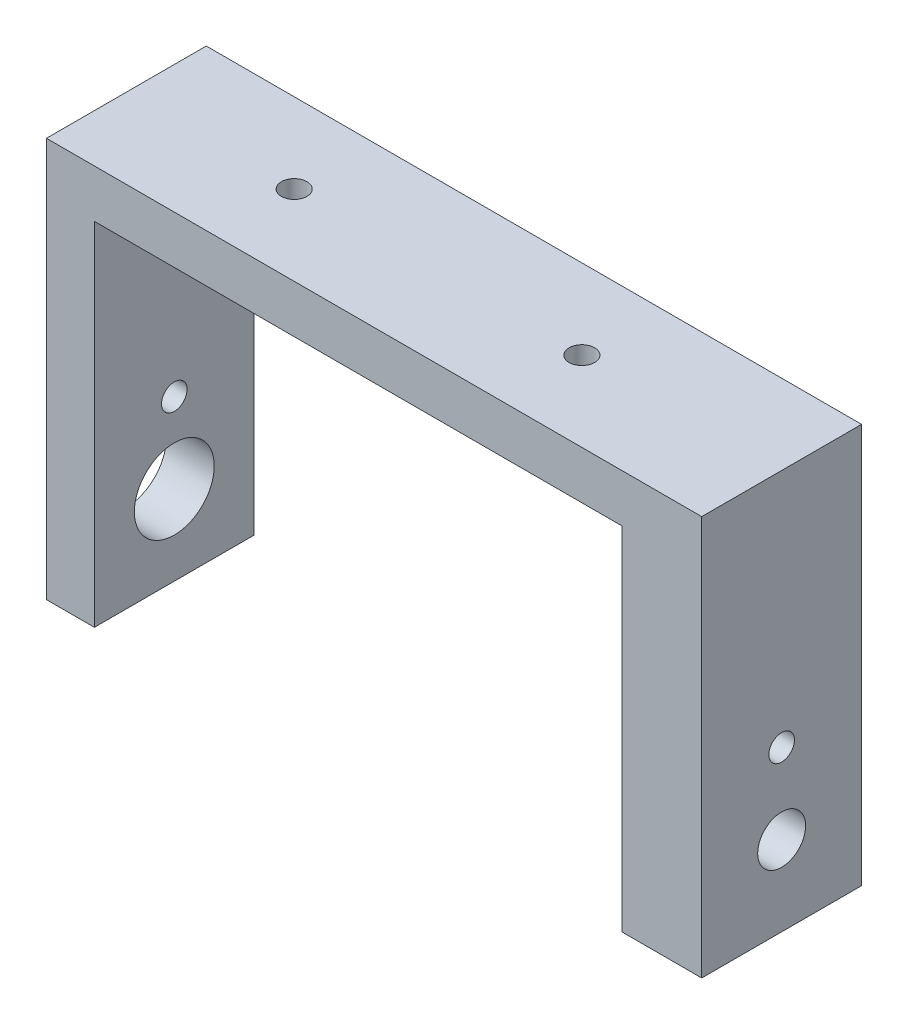
ISO-10303-21;
HEADER;
FILE_DESCRIPTION(('STEP AP214'),'2;1');
FILE_NAME('part.step','',(''),(''),'','','');
FILE_SCHEMA(('AUTOMOTIVE_DESIGN { 1 0 10303 214 1 1 1 1 }'));
ENDSEC;
DATA;
#1=APPLICATION_CONTEXT('core data for automotive mechanical design processes');
#2=APPLICATION_PROTOCOL_DEFINITION('international standard','automotive_design',2000,#1);
#3=PRODUCT_CONTEXT('',#1,'mechanical');
#4=PRODUCT('Part','Part','',(#3));
#5=PRODUCT_RELATED_PRODUCT_CATEGORY('part','',(#4));
#6=PRODUCT_DEFINITION_FORMATION('','',#4);
#7=PRODUCT_DEFINITION_CONTEXT('part definition',#1,'design');
#8=PRODUCT_DEFINITION('design','',#6,#7);
#9=PRODUCT_DEFINITION_SHAPE('','',#8);
#10=(LENGTH_UNIT() NAMED_UNIT(*) SI_UNIT(.MILLI.,.METRE.));
#11=(NAMED_UNIT(*) PLANE_ANGLE_UNIT() SI_UNIT($,.RADIAN.));
#12=(NAMED_UNIT(*) SI_UNIT($,.STERADIAN.) SOLID_ANGLE_UNIT());
#13=UNCERTAINTY_MEASURE_WITH_UNIT(LENGTH_MEASURE(1.E-05),#10,'distance_accuracy_value','');
#14=(GEOMETRIC_REPRESENTATION_CONTEXT(3) GLOBAL_UNCERTAINTY_ASSIGNED_CONTEXT((#13)) GLOBAL_UNIT_ASSIGNED_CONTEXT((#10,
#11,#12)) REPRESENTATION_CONTEXT('',''));
#15=CARTESIAN_POINT('',(0.,0.,0.));
#16=DIRECTION('',(0.,0.,1.));
#17=DIRECTION('',(1.,0.,0.));
#18=AXIS2_PLACEMENT_3D('',#15,#16,#17);
#19=CARTESIAN_POINT('',(16.5,-11.,10.));
#20=DIRECTION('',(1.,0.,0.));
#21=DIRECTION('',(0.,0.,-1.));
#22=AXIS2_PLACEMENT_3D('',#19,#20,#21);
#23=PLANE('',#22);
#24=DIRECTION('',(0.,0.,-1.));
#25=VECTOR('',#24,1.);
#26=CARTESIAN_POINT('',(16.5,-11.,10.));
#27=LINE('',#26,#25);
#28=CARTESIAN_POINT('',(16.5,-11.,1.));
#29=VERTEX_POINT('',#28);
#30=CARTESIAN_POINT('',(16.5,-11.,0.));
#31=VERTEX_POINT('',#30);
#32=EDGE_CURVE('E169',#29,#31,#27,.T.);
#33=ORIENTED_EDGE('',*,*,#32,.F.);
#34=DIRECTION('',(0.,-1.,0.));
#35=VECTOR('',#34,1.);
#36=CARTESIAN_POINT('',(16.5,-0.999999999999996,0.999999999999999));
#37=LINE('',#36,#35);
#38=CARTESIAN_POINT('',(16.5,-0.999999999999996,0.999999999999999));
#39=VERTEX_POINT('',#38);
#40=EDGE_CURVE('E256',#39,#29,#37,.T.);
#41=ORIENTED_EDGE('',*,*,#40,.F.);
#42=DIRECTION('',(0.,-0.988371697650617,-0.152057184253941));
#43=VECTOR('',#42,1.);
#44=CARTESIAN_POINT('',(16.5,12.,3.));
#45=LINE('',#44,#43);
#46=CARTESIAN_POINT('',(16.5,11.,2.84615384615384));
#47=VERTEX_POINT('',#46);
#48=EDGE_CURVE('E187',#47,#39,#45,.T.);
#49=ORIENTED_EDGE('',*,*,#48,.F.);
#50=DIRECTION('',(0.,0.,-1.));
#51=VECTOR('',#50,1.);
#52=CARTESIAN_POINT('',(16.5,11.,10.));
#53=LINE('',#52,#51);
#54=CARTESIAN_POINT('',(16.5,11.,0.));
#55=VERTEX_POINT('',#54);
#56=EDGE_CURVE('E173',#47,#55,#53,.T.);
#57=ORIENTED_EDGE('',*,*,#56,.T.);
#58=DIRECTION('',(0.,-1.,0.));
#59=VECTOR('',#58,1.);
#60=CARTESIAN_POINT('',(16.5,-11.,0.));
#61=LINE('',#60,#59);
#62=EDGE_CURVE('E151',#55,#31,#61,.T.);
#63=ORIENTED_EDGE('',*,*,#62,.T.);
#64=EDGE_LOOP('',(#33,#41,#49,#57,#63));
#65=FACE_BOUND('',#64,.T.);
#66=ADVANCED_FACE('F35',(#65),#23,.F.);
#67=CARTESIAN_POINT('',(-16.5,11.,10.));
#68=DIRECTION('',(-1.,0.,0.));
#69=DIRECTION('',(0.,0.,1.));
#70=AXIS2_PLACEMENT_3D('',#67,#68,#69);
#71=PLANE('',#70);
#72=CARTESIAN_POINT('',(-16.5,-6.,5.));
#73=DIRECTION('',(-1.,0.,0.));
#74=DIRECTION('',(0.,0.,1.));
#75=AXIS2_PLACEMENT_3D('',#72,#73,#74);
#76=CIRCLE('',#75,2.5);
#77=CARTESIAN_POINT('',(-16.5,-6.,7.5));
#78=VERTEX_POINT('',#77);
#79=EDGE_CURVE('E273',#78,#78,#76,.T.);
#80=ORIENTED_EDGE('',*,*,#79,.T.);
#81=EDGE_LOOP('',(#80));
#82=FACE_BOUND('',#81,.T.);
#83=CARTESIAN_POINT('',(-16.5,-0.999999999999994,5.));
#84=DIRECTION('',(-1.,0.,0.));
#85=DIRECTION('',(0.,0.,1.));
#86=AXIS2_PLACEMENT_3D('',#83,#84,#85);
#87=CIRCLE('',#86,0.800000000000001);
#88=CARTESIAN_POINT('',(-16.5,-0.999999999999994,5.8));
#89=VERTEX_POINT('',#88);
#90=EDGE_CURVE('E212',#89,#89,#87,.T.);
#91=ORIENTED_EDGE('',*,*,#90,.T.);
#92=EDGE_LOOP('',(#91));
#93=FACE_BOUND('',#92,.T.);
#94=DIRECTION('',(0.,1.,0.));
#95=VECTOR('',#94,1.);
#96=CARTESIAN_POINT('',(-16.5,11.,0.));
#97=LINE('',#96,#95);
#98=CARTESIAN_POINT('',(-16.5,-11.,0.));
#99=VERTEX_POINT('',#98);
#100=CARTESIAN_POINT('',(-16.5,11.,0.));
#101=VERTEX_POINT('',#100);
#102=EDGE_CURVE('E144',#99,#101,#97,.T.);
#103=ORIENTED_EDGE('',*,*,#102,.T.);
#104=DIRECTION('',(0.,0.,-1.));
#105=VECTOR('',#104,1.);
#106=CARTESIAN_POINT('',(-16.5,11.,10.));
#107=LINE('',#106,#105);
#108=CARTESIAN_POINT('',(-16.5,11.,10.));
#109=VERTEX_POINT('',#108);
#110=EDGE_CURVE('E11',#109,#101,#107,.T.);
#111=ORIENTED_EDGE('',*,*,#110,.F.);
#112=DIRECTION('',(0.,1.,0.));
#113=VECTOR('',#112,1.);
#114=CARTESIAN_POINT('',(-16.5,11.,10.));
#115=LINE('',#114,#113);
#116=CARTESIAN_POINT('',(-16.5,-11.,10.));
#117=VERTEX_POINT('',#116);
#118=EDGE_CURVE('E162',#117,#109,#115,.T.);
#119=ORIENTED_EDGE('',*,*,#118,.F.);
#120=DIRECTION('',(0.,0.,-1.));
#121=VECTOR('',#120,1.);
#122=CARTESIAN_POINT('',(-16.5,-11.,10.));
#123=LINE('',#122,#121);
#124=EDGE_CURVE('E140',#117,#99,#123,.T.);
#125=ORIENTED_EDGE('',*,*,#124,.T.);
#126=EDGE_LOOP('',(#103,#111,#119,#125));
#127=FACE_BOUND('',#126,.T.);
#128=ADVANCED_FACE('F37',(#82,#93,#127),#71,.F.);
#129=CARTESIAN_POINT('',(16.5,11.,10.));
#130=DIRECTION('',(0.,1.,0.));
#131=DIRECTION('',(0.,0.,1.));
#132=AXIS2_PLACEMENT_3D('',#129,#130,#131);
#133=PLANE('',#132);
#134=CARTESIAN_POINT('',(9.00000000000001,11.,5.));
#135=DIRECTION('',(0.,1.,0.));
#136=DIRECTION('',(0.,0.,1.));
#137=AXIS2_PLACEMENT_3D('',#134,#135,#136);
#138=CIRCLE('',#137,0.800000000000001);
#139=CARTESIAN_POINT('',(9.00000000000001,11.,5.8));
#140=VERTEX_POINT('',#139);
#141=EDGE_CURVE('E227',#140,#140,#138,.T.);
#142=ORIENTED_EDGE('',*,*,#141,.T.);
#143=EDGE_LOOP('',(#142));
#144=FACE_BOUND('',#143,.T.);
#145=CARTESIAN_POINT('',(-8.99999999999999,11.,5.));
#146=DIRECTION('',(0.,1.,0.));
#147=DIRECTION('',(0.,0.,1.));
#148=AXIS2_PLACEMENT_3D('',#145,#146,#147);
#149=CIRCLE('',#148,0.800000000000001);
#150=CARTESIAN_POINT('',(-8.99999999999999,11.,5.8));
#151=VERTEX_POINT('',#150);
#152=EDGE_CURVE('E219',#151,#151,#149,.T.);
#153=ORIENTED_EDGE('',*,*,#152,.T.);
#154=EDGE_LOOP('',(#153));
#155=FACE_BOUND('',#154,.T.);
#156=DIRECTION('',(1.,0.,0.));
#157=VECTOR('',#156,1.);
#158=CARTESIAN_POINT('',(16.5,11.,0.));
#159=LINE('',#158,#157);
#160=EDGE_CURVE('E147',#101,#55,#159,.T.);
#161=ORIENTED_EDGE('',*,*,#160,.T.);
#162=ORIENTED_EDGE('',*,*,#56,.F.);
#163=DIRECTION('',(0.,0.,-1.));
#164=VECTOR('',#163,1.);
#165=CARTESIAN_POINT('',(16.5,11.,10.));
#166=LINE('',#165,#164);
#167=CARTESIAN_POINT('',(16.5,11.,7.15384615384615));
#168=VERTEX_POINT('',#167);
#169=EDGE_CURVE('E236',#168,#47,#166,.T.);
#170=ORIENTED_EDGE('',*,*,#169,.F.);
#171=CARTESIAN_POINT('',(16.5,11.,10.));
#172=VERTEX_POINT('',#171);
#173=EDGE_CURVE('E44',#172,#168,#53,.T.);
#174=ORIENTED_EDGE('',*,*,#173,.F.);
#175=DIRECTION('',(1.,0.,0.));
#176=VECTOR('',#175,1.);
#177=CARTESIAN_POINT('',(16.5,11.,10.));
#178=LINE('',#177,#176);
#179=EDGE_CURVE('E101',#109,#172,#178,.T.);
#180=ORIENTED_EDGE('',*,*,#179,.F.);
#181=ORIENTED_EDGE('',*,*,#110,.T.);
#182=EDGE_LOOP('',(#161,#162,#170,#174,#180,#181));
#183=FACE_BOUND('',#182,.T.);
#184=ADVANCED_FACE('F189',(#144,#155,#183),#133,.F.);
#185=ORIENTED_EDGE('',*,*,#173,.T.);
#186=DIRECTION('',(0.,0.988371697650617,-0.152057184253941));
#187=VECTOR('',#186,1.);
#188=CARTESIAN_POINT('',(16.5,12.,7.));
#189=LINE('',#188,#187);
#190=CARTESIAN_POINT('',(16.5,-0.999999999999996,9.));
#191=VERTEX_POINT('',#190);
#192=EDGE_CURVE('E266',#191,#168,#189,.T.);
#193=ORIENTED_EDGE('',*,*,#192,.F.);
#194=DIRECTION('',(0.,1.,0.));
#195=VECTOR('',#194,1.);
#196=CARTESIAN_POINT('',(16.5,-0.999999999999996,9.));
#197=LINE('',#196,#195);
#198=CARTESIAN_POINT('',(16.5,-11.,9.));
#199=VERTEX_POINT('',#198);
#200=EDGE_CURVE('E270',#199,#191,#197,.T.);
#201=ORIENTED_EDGE('',*,*,#200,.F.);
#202=CARTESIAN_POINT('',(16.5,-11.,10.));
#203=VERTEX_POINT('',#202);
#204=EDGE_CURVE('E170',#203,#199,#27,.T.);
#205=ORIENTED_EDGE('',*,*,#204,.F.);
#206=DIRECTION('',(0.,-1.,0.));
#207=VECTOR('',#206,1.);
#208=CARTESIAN_POINT('',(16.5,-11.,10.));
#209=LINE('',#208,#207);
#210=EDGE_CURVE('E204',#172,#203,#209,.T.);
#211=ORIENTED_EDGE('',*,*,#210,.F.);
#212=EDGE_LOOP('',(#185,#193,#201,#205,#211));
#213=FACE_BOUND('',#212,.T.);
#214=ADVANCED_FACE('F315',(#213),#23,.F.);
#215=CARTESIAN_POINT('',(16.5,-11.,10.));
#216=DIRECTION('',(0.,1.,0.));
#217=DIRECTION('',(-1.,0.,0.));
#218=AXIS2_PLACEMENT_3D('',#215,#216,#217);
#219=PLANE('',#218);
#220=DIRECTION('',(0.,0.,1.));
#221=VECTOR('',#220,1.);
#222=CARTESIAN_POINT('',(18.5,-11.,1.));
#223=LINE('',#222,#221);
#224=CARTESIAN_POINT('',(18.5,-11.,0.999999999999999));
#225=VERTEX_POINT('',#224);
#226=CARTESIAN_POINT('',(18.5,-11.,9.));
#227=VERTEX_POINT('',#226);
#228=EDGE_CURVE('E259',#225,#227,#223,.T.);
#229=ORIENTED_EDGE('',*,*,#228,.F.);
#230=DIRECTION('',(-1.,0.,0.));
#231=VECTOR('',#230,1.);
#232=CARTESIAN_POINT('',(18.5,-11.,1.));
#233=LINE('',#232,#231);
#234=EDGE_CURVE('E239',#225,#29,#233,.T.);
#235=ORIENTED_EDGE('',*,*,#234,.T.);
#236=ORIENTED_EDGE('',*,*,#32,.T.);
#237=DIRECTION('',(1.,0.,0.));
#238=VECTOR('',#237,1.);
#239=CARTESIAN_POINT('',(16.5,-11.,0.));
#240=LINE('',#239,#238);
#241=CARTESIAN_POINT('',(21.5,-11.,0.));
#242=VERTEX_POINT('',#241);
#243=EDGE_CURVE('E154',#31,#242,#240,.T.);
#244=ORIENTED_EDGE('',*,*,#243,.T.);
#245=DIRECTION('',(0.,0.,-1.));
#246=VECTOR('',#245,1.);
#247=CARTESIAN_POINT('',(21.5,-11.,10.));
#248=LINE('',#247,#246);
#249=CARTESIAN_POINT('',(21.5,-11.,10.));
#250=VERTEX_POINT('',#249);
#251=EDGE_CURVE('E166',#250,#242,#248,.T.);
#252=ORIENTED_EDGE('',*,*,#251,.F.);
#253=DIRECTION('',(1.,0.,0.));
#254=VECTOR('',#253,1.);
#255=CARTESIAN_POINT('',(16.5,-11.,10.));
#256=LINE('',#255,#254);
#257=EDGE_CURVE('E203',#203,#250,#256,.T.);
#258=ORIENTED_EDGE('',*,*,#257,.F.);
#259=ORIENTED_EDGE('',*,*,#204,.T.);
#260=DIRECTION('',(-1.,0.,0.));
#261=VECTOR('',#260,1.);
#262=CARTESIAN_POINT('',(18.5,-11.,9.));
#263=LINE('',#262,#261);
#264=EDGE_CURVE('E240',#227,#199,#263,.T.);
#265=ORIENTED_EDGE('',*,*,#264,.F.);
#266=EDGE_LOOP('',(#229,#235,#236,#244,#252,#258,#259,#265));
#267=FACE_BOUND('',#266,.T.);
#268=ADVANCED_FACE('F198',(#267),#219,.F.);
#269=CARTESIAN_POINT('',(21.5,-11.,10.));
#270=DIRECTION('',(-1.,0.,0.));
#271=DIRECTION('',(0.,0.,1.));
#272=AXIS2_PLACEMENT_3D('',#269,#270,#271);
#273=PLANE('',#272);
#274=CARTESIAN_POINT('',(21.5,-0.999999999999994,5.));
#275=DIRECTION('',(-1.,0.,0.));
#276=DIRECTION('',(0.,0.,1.));
#277=AXIS2_PLACEMENT_3D('',#274,#275,#276);
#278=CIRCLE('',#277,0.800000000000001);
#279=CARTESIAN_POINT('',(21.5,-0.999999999999994,5.8));
#280=VERTEX_POINT('',#279);
#281=EDGE_CURVE('E215',#280,#280,#278,.T.);
#282=ORIENTED_EDGE('',*,*,#281,.T.);
#283=EDGE_LOOP('',(#282));
#284=FACE_BOUND('',#283,.T.);
#285=CARTESIAN_POINT('',(21.5,-6.,5.));
#286=DIRECTION('',(-1.,0.,0.));
#287=DIRECTION('',(0.,0.,1.));
#288=AXIS2_PLACEMENT_3D('',#285,#286,#287);
#289=CIRCLE('',#288,1.5);
#290=CARTESIAN_POINT('',(21.5,-6.,6.5));
#291=VERTEX_POINT('',#290);
#292=EDGE_CURVE('E148',#291,#291,#289,.T.);
#293=ORIENTED_EDGE('',*,*,#292,.T.);
#294=EDGE_LOOP('',(#293));
#295=FACE_BOUND('',#294,.T.);
#296=DIRECTION('',(0.,1.,0.));
#297=VECTOR('',#296,1.);
#298=CARTESIAN_POINT('',(21.5,-11.,0.));
#299=LINE('',#298,#297);
#300=CARTESIAN_POINT('',(21.5,14.,0.));
#301=VERTEX_POINT('',#300);
#302=EDGE_CURVE('E156',#242,#301,#299,.T.);
#303=ORIENTED_EDGE('',*,*,#302,.T.);
#304=DIRECTION('',(0.,0.,-1.));
#305=VECTOR('',#304,1.);
#306=CARTESIAN_POINT('',(21.5,14.,10.));
#307=LINE('',#306,#305);
#308=CARTESIAN_POINT('',(21.5,14.,10.));
#309=VERTEX_POINT('',#308);
#310=EDGE_CURVE('E135',#309,#301,#307,.T.);
#311=ORIENTED_EDGE('',*,*,#310,.F.);
#312=DIRECTION('',(0.,1.,0.));
#313=VECTOR('',#312,1.);
#314=CARTESIAN_POINT('',(21.5,-11.,10.));
#315=LINE('',#314,#313);
#316=EDGE_CURVE('E123',#250,#309,#315,.T.);
#317=ORIENTED_EDGE('',*,*,#316,.F.);
#318=ORIENTED_EDGE('',*,*,#251,.T.);
#319=EDGE_LOOP('',(#303,#311,#317,#318));
#320=FACE_BOUND('',#319,.T.);
#321=ADVANCED_FACE('F202',(#284,#295,#320),#273,.F.);
#322=CARTESIAN_POINT('',(21.5,14.,10.));
#323=DIRECTION('',(0.,-1.,0.));
#324=DIRECTION('',(0.,0.,-1.));
#325=AXIS2_PLACEMENT_3D('',#322,#323,#324);
#326=PLANE('',#325);
#327=CARTESIAN_POINT('',(9.00000000000001,14.,5.));
#328=DIRECTION('',(0.,1.,0.));
#329=DIRECTION('',(0.,0.,1.));
#330=AXIS2_PLACEMENT_3D('',#327,#328,#329);
#331=CIRCLE('',#330,0.800000000000001);
#332=CARTESIAN_POINT('',(9.00000000000001,14.,5.8));
#333=VERTEX_POINT('',#332);
#334=EDGE_CURVE('E230',#333,#333,#331,.T.);
#335=ORIENTED_EDGE('',*,*,#334,.F.);
#336=EDGE_LOOP('',(#335));
#337=FACE_BOUND('',#336,.T.);
#338=CARTESIAN_POINT('',(-8.99999999999999,14.,5.));
#339=DIRECTION('',(0.,1.,0.));
#340=DIRECTION('',(0.,0.,1.));
#341=AXIS2_PLACEMENT_3D('',#338,#339,#340);
#342=CIRCLE('',#341,0.800000000000001);
#343=CARTESIAN_POINT('',(-8.99999999999999,14.,5.8));
#344=VERTEX_POINT('',#343);
#345=EDGE_CURVE('E224',#344,#344,#342,.T.);
#346=ORIENTED_EDGE('',*,*,#345,.F.);
#347=EDGE_LOOP('',(#346));
#348=FACE_BOUND('',#347,.T.);
#349=DIRECTION('',(-1.,0.,0.));
#350=VECTOR('',#349,1.);
#351=CARTESIAN_POINT('',(21.5,14.,0.));
#352=LINE('',#351,#350);
#353=CARTESIAN_POINT('',(-19.5,14.,0.));
#354=VERTEX_POINT('',#353);
#355=EDGE_CURVE('E132',#301,#354,#352,.T.);
#356=ORIENTED_EDGE('',*,*,#355,.T.);
#357=DIRECTION('',(0.,0.,-1.));
#358=VECTOR('',#357,1.);
#359=CARTESIAN_POINT('',(-19.5,14.,10.));
#360=LINE('',#359,#358);
#361=CARTESIAN_POINT('',(-19.5,14.,10.));
#362=VERTEX_POINT('',#361);
#363=EDGE_CURVE('E129',#362,#354,#360,.T.);
#364=ORIENTED_EDGE('',*,*,#363,.F.);
#365=DIRECTION('',(-1.,0.,0.));
#366=VECTOR('',#365,1.);
#367=CARTESIAN_POINT('',(21.5,14.,10.));
#368=LINE('',#367,#366);
#369=EDGE_CURVE('E116',#309,#362,#368,.T.);
#370=ORIENTED_EDGE('',*,*,#369,.F.);
#371=ORIENTED_EDGE('',*,*,#310,.T.);
#372=EDGE_LOOP('',(#356,#364,#370,#371));
#373=FACE_BOUND('',#372,.T.);
#374=ADVANCED_FACE('F130',(#337,#348,#373),#326,.F.);
#375=CARTESIAN_POINT('',(-19.5,-11.,10.));
#376=DIRECTION('',(1.,0.,0.));
#377=DIRECTION('',(0.,0.,-1.));
#378=AXIS2_PLACEMENT_3D('',#375,#376,#377);
#379=PLANE('',#378);
#380=CARTESIAN_POINT('',(-19.5,-6.,5.));
#381=DIRECTION('',(-1.,0.,0.));
#382=DIRECTION('',(0.,0.,1.));
#383=AXIS2_PLACEMENT_3D('',#380,#381,#382);
#384=CIRCLE('',#383,2.5);
#385=CARTESIAN_POINT('',(-19.5,-6.,7.5));
#386=VERTEX_POINT('',#385);
#387=EDGE_CURVE('E289',#386,#386,#384,.T.);
#388=ORIENTED_EDGE('',*,*,#387,.F.);
#389=EDGE_LOOP('',(#388));
#390=FACE_BOUND('',#389,.T.);
#391=CARTESIAN_POINT('',(-19.5,-0.999999999999994,5.));
#392=DIRECTION('',(-1.,0.,0.));
#393=DIRECTION('',(0.,0.,1.));
#394=AXIS2_PLACEMENT_3D('',#391,#392,#393);
#395=CIRCLE('',#394,0.800000000000001);
#396=CARTESIAN_POINT('',(-19.5,-0.999999999999994,5.8));
#397=VERTEX_POINT('',#396);
#398=EDGE_CURVE('E216',#397,#397,#395,.T.);
#399=ORIENTED_EDGE('',*,*,#398,.F.);
#400=EDGE_LOOP('',(#399));
#401=FACE_BOUND('',#400,.T.);
#402=DIRECTION('',(0.,-1.,0.));
#403=VECTOR('',#402,1.);
#404=CARTESIAN_POINT('',(-19.5,-11.,0.));
#405=LINE('',#404,#403);
#406=CARTESIAN_POINT('',(-19.5,-11.,0.));
#407=VERTEX_POINT('',#406);
#408=EDGE_CURVE('E159',#354,#407,#405,.T.);
#409=ORIENTED_EDGE('',*,*,#408,.T.);
#410=DIRECTION('',(0.,0.,-1.));
#411=VECTOR('',#410,1.);
#412=CARTESIAN_POINT('',(-19.5,-11.,10.));
#413=LINE('',#412,#411);
#414=CARTESIAN_POINT('',(-19.5,-11.,10.));
#415=VERTEX_POINT('',#414);
#416=EDGE_CURVE('E136',#415,#407,#413,.T.);
#417=ORIENTED_EDGE('',*,*,#416,.F.);
#418=DIRECTION('',(0.,-1.,0.));
#419=VECTOR('',#418,1.);
#420=CARTESIAN_POINT('',(-19.5,-11.,10.));
#421=LINE('',#420,#419);
#422=EDGE_CURVE('E120',#362,#415,#421,.T.);
#423=ORIENTED_EDGE('',*,*,#422,.F.);
#424=ORIENTED_EDGE('',*,*,#363,.T.);
#425=EDGE_LOOP('',(#409,#417,#423,#424));
#426=FACE_BOUND('',#425,.T.);
#427=ADVANCED_FACE('F138',(#390,#401,#426),#379,.F.);
#428=CARTESIAN_POINT('',(-16.5,-11.,10.));
#429=DIRECTION('',(0.,1.,0.));
#430=DIRECTION('',(0.,0.,1.));
#431=AXIS2_PLACEMENT_3D('',#428,#429,#430);
#432=PLANE('',#431);
#433=DIRECTION('',(1.,0.,0.));
#434=VECTOR('',#433,1.);
#435=CARTESIAN_POINT('',(-16.5,-11.,0.));
#436=LINE('',#435,#434);
#437=EDGE_CURVE('E93',#407,#99,#436,.T.);
#438=ORIENTED_EDGE('',*,*,#437,.T.);
#439=ORIENTED_EDGE('',*,*,#124,.F.);
#440=DIRECTION('',(1.,0.,0.));
#441=VECTOR('',#440,1.);
#442=CARTESIAN_POINT('',(-16.5,-11.,10.));
#443=LINE('',#442,#441);
#444=EDGE_CURVE('E60',#415,#117,#443,.T.);
#445=ORIENTED_EDGE('',*,*,#444,.F.);
#446=ORIENTED_EDGE('',*,*,#416,.T.);
#447=EDGE_LOOP('',(#438,#439,#445,#446));
#448=FACE_BOUND('',#447,.T.);
#449=ADVANCED_FACE('F298',(#448),#432,.F.);
#450=CARTESIAN_POINT('',(0.,0.,10.));
#451=DIRECTION('',(0.,0.,-1.));
#452=DIRECTION('',(-1.,0.,0.));
#453=AXIS2_PLACEMENT_3D('',#450,#451,#452);
#454=PLANE('',#453);
#455=ORIENTED_EDGE('',*,*,#118,.T.);
#456=ORIENTED_EDGE('',*,*,#179,.T.);
#457=ORIENTED_EDGE('',*,*,#210,.T.);
#458=ORIENTED_EDGE('',*,*,#257,.T.);
#459=ORIENTED_EDGE('',*,*,#316,.T.);
#460=ORIENTED_EDGE('',*,*,#369,.T.);
#461=ORIENTED_EDGE('',*,*,#422,.T.);
#462=ORIENTED_EDGE('',*,*,#444,.T.);
#463=EDGE_LOOP('',(#455,#456,#457,#458,#459,#460,#461,#462));
#464=FACE_BOUND('',#463,.T.);
#465=ADVANCED_FACE('F118',(#464),#454,.F.);
#466=CARTESIAN_POINT('',(0.,0.,0.));
#467=DIRECTION('',(0.,0.,-1.));
#468=DIRECTION('',(-1.,0.,0.));
#469=AXIS2_PLACEMENT_3D('',#466,#467,#468);
#470=PLANE('',#469);
#471=ORIENTED_EDGE('',*,*,#102,.F.);
#472=ORIENTED_EDGE('',*,*,#437,.F.);
#473=ORIENTED_EDGE('',*,*,#408,.F.);
#474=ORIENTED_EDGE('',*,*,#355,.F.);
#475=ORIENTED_EDGE('',*,*,#302,.F.);
#476=ORIENTED_EDGE('',*,*,#243,.F.);
#477=ORIENTED_EDGE('',*,*,#62,.F.);
#478=ORIENTED_EDGE('',*,*,#160,.F.);
#479=EDGE_LOOP('',(#471,#472,#473,#474,#475,#476,#477,#478));
#480=FACE_BOUND('',#479,.T.);
#481=ADVANCED_FACE('F193',(#480),#470,.T.);
#482=CARTESIAN_POINT('',(21.5,-6.,5.));
#483=DIRECTION('',(-1.,0.,0.));
#484=DIRECTION('',(0.,0.,1.));
#485=AXIS2_PLACEMENT_3D('',#482,#483,#484);
#486=CYLINDRICAL_SURFACE('',#485,1.5);
#487=CARTESIAN_POINT('',(18.5,-6.,5.));
#488=DIRECTION('',(1.,0.,0.));
#489=DIRECTION('',(0.,0.,-1.));
#490=AXIS2_PLACEMENT_3D('',#487,#488,#489);
#491=CIRCLE('',#490,1.5);
#492=CARTESIAN_POINT('',(18.5,-6.,3.5));
#493=VERTEX_POINT('',#492);
#494=EDGE_CURVE('E233',#493,#493,#491,.F.);
#495=ORIENTED_EDGE('',*,*,#494,.T.);
#496=EDGE_LOOP('',(#495));
#497=FACE_BOUND('',#496,.T.);
#498=ORIENTED_EDGE('',*,*,#292,.F.);
#499=EDGE_LOOP('',(#498));
#500=FACE_BOUND('',#499,.T.);
#501=ADVANCED_FACE('F306',(#497,#500),#486,.F.);
#502=CARTESIAN_POINT('',(21.5,-0.999999999999994,5.));
#503=DIRECTION('',(-1.,0.,0.));
#504=DIRECTION('',(0.,0.,1.));
#505=AXIS2_PLACEMENT_3D('',#502,#503,#504);
#506=CYLINDRICAL_SURFACE('',#505,0.800000000000001);
#507=ORIENTED_EDGE('',*,*,#398,.T.);
#508=EDGE_LOOP('',(#507));
#509=FACE_BOUND('',#508,.T.);
#510=ORIENTED_EDGE('',*,*,#90,.F.);
#511=EDGE_LOOP('',(#510));
#512=FACE_BOUND('',#511,.T.);
#513=ADVANCED_FACE('F302',(#509,#512),#506,.F.);
#514=CARTESIAN_POINT('',(18.5,-0.999999999999994,5.));
#515=DIRECTION('',(1.,0.,0.));
#516=DIRECTION('',(0.,0.,-1.));
#517=AXIS2_PLACEMENT_3D('',#514,#515,#516);
#518=CIRCLE('',#517,0.800000000000001);
#519=CARTESIAN_POINT('',(18.5,-0.999999999999994,4.2));
#520=VERTEX_POINT('',#519);
#521=EDGE_CURVE('E39',#520,#520,#518,.F.);
#522=ORIENTED_EDGE('',*,*,#521,.T.);
#523=EDGE_LOOP('',(#522));
#524=FACE_BOUND('',#523,.T.);
#525=ORIENTED_EDGE('',*,*,#281,.F.);
#526=EDGE_LOOP('',(#525));
#527=FACE_BOUND('',#526,.T.);
#528=ADVANCED_FACE('F305',(#524,#527),#506,.F.);
#529=CARTESIAN_POINT('',(-8.99999999999999,-11.,5.));
#530=DIRECTION('',(0.,1.,0.));
#531=DIRECTION('',(0.,0.,1.));
#532=AXIS2_PLACEMENT_3D('',#529,#530,#531);
#533=CYLINDRICAL_SURFACE('',#532,0.800000000000001);
#534=ORIENTED_EDGE('',*,*,#345,.T.);
#535=EDGE_LOOP('',(#534));
#536=FACE_BOUND('',#535,.T.);
#537=ORIENTED_EDGE('',*,*,#152,.F.);
#538=EDGE_LOOP('',(#537));
#539=FACE_BOUND('',#538,.T.);
#540=ADVANCED_FACE('F388',(#536,#539),#533,.F.);
#541=CARTESIAN_POINT('',(9.00000000000001,-11.,5.));
#542=DIRECTION('',(0.,1.,0.));
#543=DIRECTION('',(0.,0.,1.));
#544=AXIS2_PLACEMENT_3D('',#541,#542,#543);
#545=CYLINDRICAL_SURFACE('',#544,0.800000000000001);
#546=ORIENTED_EDGE('',*,*,#334,.T.);
#547=EDGE_LOOP('',(#546));
#548=FACE_BOUND('',#547,.T.);
#549=ORIENTED_EDGE('',*,*,#141,.F.);
#550=EDGE_LOOP('',(#549));
#551=FACE_BOUND('',#550,.T.);
#552=ADVANCED_FACE('F390',(#548,#551),#545,.F.);
#553=CARTESIAN_POINT('',(18.5,0.,0.));
#554=DIRECTION('',(1.,0.,0.));
#555=DIRECTION('',(0.,0.,-1.));
#556=AXIS2_PLACEMENT_3D('',#553,#554,#555);
#557=PLANE('',#556);
#558=ORIENTED_EDGE('',*,*,#521,.F.);
#559=EDGE_LOOP('',(#558));
#560=FACE_BOUND('',#559,.T.);
#561=ORIENTED_EDGE('',*,*,#228,.T.);
#562=DIRECTION('',(0.,1.,0.));
#563=VECTOR('',#562,1.);
#564=CARTESIAN_POINT('',(18.5,-0.999999999999996,9.));
#565=LINE('',#564,#563);
#566=CARTESIAN_POINT('',(18.5,-0.999999999999996,9.));
#567=VERTEX_POINT('',#566);
#568=EDGE_CURVE('E283',#227,#567,#565,.T.);
#569=ORIENTED_EDGE('',*,*,#568,.T.);
#570=DIRECTION('',(0.,0.988371697650617,-0.152057184253941));
#571=VECTOR('',#570,1.);
#572=CARTESIAN_POINT('',(18.5,12.,7.));
#573=LINE('',#572,#571);
#574=CARTESIAN_POINT('',(18.5,12.,7.));
#575=VERTEX_POINT('',#574);
#576=EDGE_CURVE('E280',#567,#575,#573,.T.);
#577=ORIENTED_EDGE('',*,*,#576,.T.);
#578=DIRECTION('',(0.,0.,-1.));
#579=VECTOR('',#578,1.);
#580=CARTESIAN_POINT('',(18.5,12.,3.));
#581=LINE('',#580,#579);
#582=CARTESIAN_POINT('',(18.5,12.,3.));
#583=VERTEX_POINT('',#582);
#584=EDGE_CURVE('E277',#575,#583,#581,.T.);
#585=ORIENTED_EDGE('',*,*,#584,.T.);
#586=DIRECTION('',(0.,-0.988371697650617,-0.152057184253941));
#587=VECTOR('',#586,1.);
#588=CARTESIAN_POINT('',(18.5,12.,3.));
#589=LINE('',#588,#587);
#590=CARTESIAN_POINT('',(18.5,-0.999999999999996,0.999999999999999));
#591=VERTEX_POINT('',#590);
#592=EDGE_CURVE('E275',#583,#591,#589,.T.);
#593=ORIENTED_EDGE('',*,*,#592,.T.);
#594=DIRECTION('',(0.,-1.,0.));
#595=VECTOR('',#594,1.);
#596=CARTESIAN_POINT('',(18.5,-0.999999999999996,0.999999999999999));
#597=LINE('',#596,#595);
#598=EDGE_CURVE('E51',#591,#225,#597,.T.);
#599=ORIENTED_EDGE('',*,*,#598,.T.);
#600=EDGE_LOOP('',(#561,#569,#577,#585,#593,#599));
#601=FACE_BOUND('',#600,.T.);
#602=ORIENTED_EDGE('',*,*,#494,.F.);
#603=EDGE_LOOP('',(#602));
#604=FACE_BOUND('',#603,.T.);
#605=ADVANCED_FACE('F356',(#560,#601,#604),#557,.F.);
#606=CARTESIAN_POINT('',(16.5,0.,0.));
#607=DIRECTION('',(1.,0.,0.));
#608=DIRECTION('',(0.,0.,-1.));
#609=AXIS2_PLACEMENT_3D('',#606,#607,#608);
#610=PLANE('',#609);
#611=ORIENTED_EDGE('',*,*,#169,.T.);
#612=CARTESIAN_POINT('',(16.5,12.,3.));
#613=VERTEX_POINT('',#612);
#614=EDGE_CURVE('E260',#613,#47,#45,.T.);
#615=ORIENTED_EDGE('',*,*,#614,.F.);
#616=DIRECTION('',(0.,0.,-1.));
#617=VECTOR('',#616,1.);
#618=CARTESIAN_POINT('',(16.5,12.,3.));
#619=LINE('',#618,#617);
#620=CARTESIAN_POINT('',(16.5,12.,7.));
#621=VERTEX_POINT('',#620);
#622=EDGE_CURVE('E263',#621,#613,#619,.T.);
#623=ORIENTED_EDGE('',*,*,#622,.F.);
#624=EDGE_CURVE('E269',#168,#621,#189,.T.);
#625=ORIENTED_EDGE('',*,*,#624,.F.);
#626=EDGE_LOOP('',(#611,#615,#623,#625));
#627=FACE_BOUND('',#626,.T.);
#628=ADVANCED_FACE('F362',(#627),#610,.T.);
#629=CARTESIAN_POINT('',(18.5,-0.999999999999996,0.999999999999999));
#630=DIRECTION('',(0.,0.,-1.));
#631=DIRECTION('',(0.,1.,0.));
#632=AXIS2_PLACEMENT_3D('',#629,#630,#631);
#633=PLANE('',#632);
#634=ORIENTED_EDGE('',*,*,#40,.T.);
#635=ORIENTED_EDGE('',*,*,#234,.F.);
#636=ORIENTED_EDGE('',*,*,#598,.F.);
#637=DIRECTION('',(-1.,0.,0.));
#638=VECTOR('',#637,1.);
#639=CARTESIAN_POINT('',(18.5,-0.999999999999996,0.999999999999999));
#640=LINE('',#639,#638);
#641=EDGE_CURVE('E252',#591,#39,#640,.T.);
#642=ORIENTED_EDGE('',*,*,#641,.T.);
#643=EDGE_LOOP('',(#634,#635,#636,#642));
#644=FACE_BOUND('',#643,.T.);
#645=ADVANCED_FACE('F359',(#644),#633,.F.);
#646=CARTESIAN_POINT('',(18.5,12.,3.));
#647=DIRECTION('',(0.,0.152057184253941,-0.988371697650617));
#648=DIRECTION('',(0.,0.988371697650617,0.152057184253941));
#649=AXIS2_PLACEMENT_3D('',#646,#647,#648);
#650=PLANE('',#649);
#651=ORIENTED_EDGE('',*,*,#614,.T.);
#652=ORIENTED_EDGE('',*,*,#48,.T.);
#653=ORIENTED_EDGE('',*,*,#641,.F.);
#654=ORIENTED_EDGE('',*,*,#592,.F.);
#655=DIRECTION('',(-1.,0.,0.));
#656=VECTOR('',#655,1.);
#657=CARTESIAN_POINT('',(18.5,12.,3.));
#658=LINE('',#657,#656);
#659=EDGE_CURVE('E249',#583,#613,#658,.T.);
#660=ORIENTED_EDGE('',*,*,#659,.T.);
#661=EDGE_LOOP('',(#651,#652,#653,#654,#660));
#662=FACE_BOUND('',#661,.T.);
#663=ADVANCED_FACE('F361',(#662),#650,.F.);
#664=CARTESIAN_POINT('',(18.5,12.,3.));
#665=DIRECTION('',(0.,1.,0.));
#666=DIRECTION('',(0.,0.,1.));
#667=AXIS2_PLACEMENT_3D('',#664,#665,#666);
#668=PLANE('',#667);
#669=ORIENTED_EDGE('',*,*,#622,.T.);
#670=ORIENTED_EDGE('',*,*,#659,.F.);
#671=ORIENTED_EDGE('',*,*,#584,.F.);
#672=DIRECTION('',(-1.,0.,0.));
#673=VECTOR('',#672,1.);
#674=CARTESIAN_POINT('',(18.5,12.,7.));
#675=LINE('',#674,#673);
#676=EDGE_CURVE('E246',#575,#621,#675,.T.);
#677=ORIENTED_EDGE('',*,*,#676,.T.);
#678=EDGE_LOOP('',(#669,#670,#671,#677));
#679=FACE_BOUND('',#678,.T.);
#680=ADVANCED_FACE('F368',(#679),#668,.F.);
#681=CARTESIAN_POINT('',(18.5,12.,7.));
#682=DIRECTION('',(0.,0.152057184253941,0.988371697650617));
#683=DIRECTION('',(0.,-0.988371697650617,0.152057184253941));
#684=AXIS2_PLACEMENT_3D('',#681,#682,#683);
#685=PLANE('',#684);
#686=ORIENTED_EDGE('',*,*,#192,.T.);
#687=ORIENTED_EDGE('',*,*,#624,.T.);
#688=ORIENTED_EDGE('',*,*,#676,.F.);
#689=ORIENTED_EDGE('',*,*,#576,.F.);
#690=DIRECTION('',(-1.,0.,0.));
#691=VECTOR('',#690,1.);
#692=CARTESIAN_POINT('',(18.5,-0.999999999999996,9.));
#693=LINE('',#692,#691);
#694=EDGE_CURVE('E243',#567,#191,#693,.T.);
#695=ORIENTED_EDGE('',*,*,#694,.T.);
#696=EDGE_LOOP('',(#686,#687,#688,#689,#695));
#697=FACE_BOUND('',#696,.T.);
#698=ADVANCED_FACE('F495',(#697),#685,.F.);
#699=CARTESIAN_POINT('',(18.5,-0.999999999999996,9.));
#700=DIRECTION('',(0.,0.,1.));
#701=DIRECTION('',(1.,0.,0.));
#702=AXIS2_PLACEMENT_3D('',#699,#700,#701);
#703=PLANE('',#702);
#704=ORIENTED_EDGE('',*,*,#200,.T.);
#705=ORIENTED_EDGE('',*,*,#694,.F.);
#706=ORIENTED_EDGE('',*,*,#568,.F.);
#707=ORIENTED_EDGE('',*,*,#264,.T.);
#708=EDGE_LOOP('',(#704,#705,#706,#707));
#709=FACE_BOUND('',#708,.T.);
#710=ADVANCED_FACE('F354',(#709),#703,.F.);
#711=CARTESIAN_POINT('',(-9.49999999999999,-6.,5.));
#712=DIRECTION('',(-1.,0.,0.));
#713=DIRECTION('',(0.,0.,1.));
#714=AXIS2_PLACEMENT_3D('',#711,#712,#713);
#715=CYLINDRICAL_SURFACE('',#714,2.5);
#716=ORIENTED_EDGE('',*,*,#387,.T.);
#717=EDGE_LOOP('',(#716));
#718=FACE_BOUND('',#717,.T.);
#719=ORIENTED_EDGE('',*,*,#79,.F.);
#720=EDGE_LOOP('',(#719));
#721=FACE_BOUND('',#720,.T.);
#722=ADVANCED_FACE('F293',(#718,#721),#715,.F.);
#723=CLOSED_SHELL('',(#66,#128,#184,#214,#268,#321,#374,#427,#449,#465,#481,#501,#513,#528,#540,
#552,#605,#628,#645,#663,#680,#698,#710,#722));
#724=MANIFOLD_SOLID_BREP('B2',#723);
#725=ADVANCED_BREP_SHAPE_REPRESENTATION('',(#18,#724),#14);
#726=SHAPE_DEFINITION_REPRESENTATION(#9,#725);
ENDSEC;
END-ISO-10303-21;
